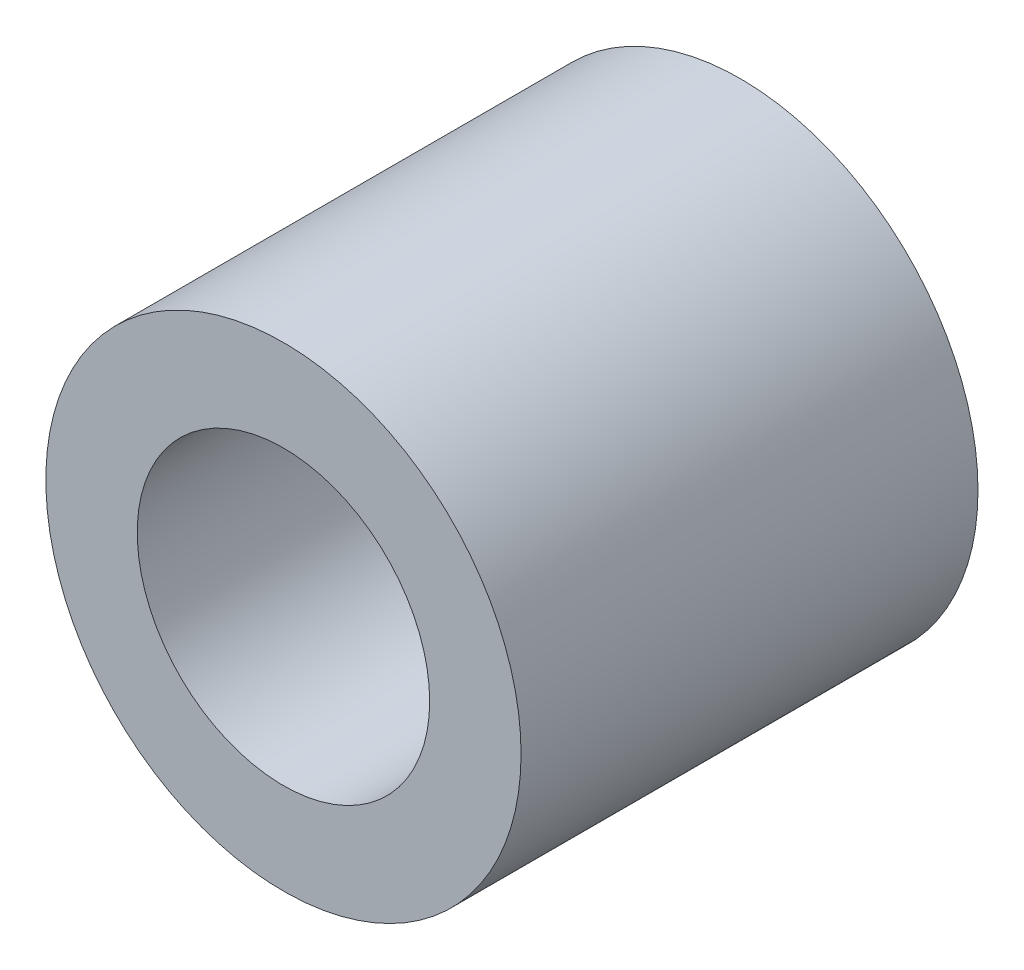
ISO-10303-21;
HEADER;
FILE_DESCRIPTION(('STEP AP214'),'2;1');
FILE_NAME('part.step','',(''),(''),'','','');
FILE_SCHEMA(('AUTOMOTIVE_DESIGN { 1 0 10303 214 1 1 1 1 }'));
ENDSEC;
DATA;
#1=APPLICATION_CONTEXT('core data for automotive mechanical design processes');
#2=APPLICATION_PROTOCOL_DEFINITION('international standard','automotive_design',2000,#1);
#3=PRODUCT_CONTEXT('',#1,'mechanical');
#4=PRODUCT('Part','Part','',(#3));
#5=PRODUCT_RELATED_PRODUCT_CATEGORY('part','',(#4));
#6=PRODUCT_DEFINITION_FORMATION('','',#4);
#7=PRODUCT_DEFINITION_CONTEXT('part definition',#1,'design');
#8=PRODUCT_DEFINITION('design','',#6,#7);
#9=PRODUCT_DEFINITION_SHAPE('','',#8);
#10=(LENGTH_UNIT() NAMED_UNIT(*) SI_UNIT(.MILLI.,.METRE.));
#11=(NAMED_UNIT(*) PLANE_ANGLE_UNIT() SI_UNIT($,.RADIAN.));
#12=(NAMED_UNIT(*) SI_UNIT($,.STERADIAN.) SOLID_ANGLE_UNIT());
#13=UNCERTAINTY_MEASURE_WITH_UNIT(LENGTH_MEASURE(1.E-05),#10,'distance_accuracy_value','');
#14=(GEOMETRIC_REPRESENTATION_CONTEXT(3) GLOBAL_UNCERTAINTY_ASSIGNED_CONTEXT((#13)) GLOBAL_UNIT_ASSIGNED_CONTEXT((#10,
#11,#12)) REPRESENTATION_CONTEXT('',''));
#15=CARTESIAN_POINT('',(0.,0.,0.));
#16=DIRECTION('',(0.,0.,1.));
#17=DIRECTION('',(1.,0.,0.));
#18=AXIS2_PLACEMENT_3D('',#15,#16,#17);
#19=CARTESIAN_POINT('',(1.45000000003573,330.999999999972,5.));
#20=DIRECTION('',(0.,0.,-1.));
#21=DIRECTION('',(-1.,0.,0.));
#22=AXIS2_PLACEMENT_3D('',#19,#20,#21);
#23=CYLINDRICAL_SURFACE('',#22,2.6);
#24=CARTESIAN_POINT('',(1.45000000003573,330.999999999972,5.));
#25=DIRECTION('',(0.,0.,1.));
#26=DIRECTION('',(1.,0.,0.));
#27=AXIS2_PLACEMENT_3D('',#24,#25,#26);
#28=CIRCLE('',#27,2.6);
#29=CARTESIAN_POINT('',(4.05000000003572,330.999999999972,5.));
#30=VERTEX_POINT('',#29);
#31=EDGE_CURVE('E10',#30,#30,#28,.T.);
#32=ORIENTED_EDGE('',*,*,#31,.F.);
#33=EDGE_LOOP('',(#32));
#34=FACE_BOUND('',#33,.T.);
#35=CARTESIAN_POINT('',(1.45000000003573,330.999999999972,0.));
#36=DIRECTION('',(0.,0.,1.));
#37=DIRECTION('',(1.,0.,0.));
#38=AXIS2_PLACEMENT_3D('',#35,#36,#37);
#39=CIRCLE('',#38,2.6);
#40=CARTESIAN_POINT('',(4.05000000003572,330.999999999972,0.));
#41=VERTEX_POINT('',#40);
#42=EDGE_CURVE('E33',#41,#41,#39,.T.);
#43=ORIENTED_EDGE('',*,*,#42,.T.);
#44=EDGE_LOOP('',(#43));
#45=FACE_BOUND('',#44,.T.);
#46=ADVANCED_FACE('F30',(#34,#45),#23,.T.);
#47=CARTESIAN_POINT('',(1.45000000003573,330.999999999972,5.));
#48=DIRECTION('',(0.,0.,1.));
#49=DIRECTION('',(1.,0.,0.));
#50=AXIS2_PLACEMENT_3D('',#47,#48,#49);
#51=PLANE('',#50);
#52=CARTESIAN_POINT('',(1.45000000003573,330.999999999972,5.));
#53=DIRECTION('',(0.,0.,1.));
#54=DIRECTION('',(1.,0.,0.));
#55=AXIS2_PLACEMENT_3D('',#52,#53,#54);
#56=CIRCLE('',#55,1.6);
#57=CARTESIAN_POINT('',(3.05000000003573,330.999999999972,5.));
#58=VERTEX_POINT('',#57);
#59=EDGE_CURVE('E44',#58,#58,#56,.T.);
#60=ORIENTED_EDGE('',*,*,#59,.F.);
#61=EDGE_LOOP('',(#60));
#62=FACE_BOUND('',#61,.T.);
#63=ORIENTED_EDGE('',*,*,#31,.T.);
#64=EDGE_LOOP('',(#63));
#65=FACE_BOUND('',#64,.T.);
#66=ADVANCED_FACE('F51',(#62,#65),#51,.T.);
#67=CARTESIAN_POINT('',(1.45000000003573,330.999999999972,0.));
#68=DIRECTION('',(0.,0.,1.));
#69=DIRECTION('',(1.,0.,0.));
#70=AXIS2_PLACEMENT_3D('',#67,#68,#69);
#71=PLANE('',#70);
#72=CARTESIAN_POINT('',(1.45000000003573,330.999999999972,0.));
#73=DIRECTION('',(0.,0.,1.));
#74=DIRECTION('',(1.,0.,0.));
#75=AXIS2_PLACEMENT_3D('',#72,#73,#74);
#76=CIRCLE('',#75,1.6);
#77=CARTESIAN_POINT('',(3.05000000003572,330.999999999972,0.));
#78=VERTEX_POINT('',#77);
#79=EDGE_CURVE('E40',#78,#78,#76,.T.);
#80=ORIENTED_EDGE('',*,*,#79,.T.);
#81=EDGE_LOOP('',(#80));
#82=FACE_BOUND('',#81,.T.);
#83=ORIENTED_EDGE('',*,*,#42,.F.);
#84=EDGE_LOOP('',(#83));
#85=FACE_BOUND('',#84,.T.);
#86=ADVANCED_FACE('F53',(#82,#85),#71,.F.);
#87=CARTESIAN_POINT('',(1.45000000003573,330.999999999972,5.));
#88=DIRECTION('',(0.,0.,1.));
#89=DIRECTION('',(1.,0.,0.));
#90=AXIS2_PLACEMENT_3D('',#87,#88,#89);
#91=CYLINDRICAL_SURFACE('',#90,1.6);
#92=ORIENTED_EDGE('',*,*,#59,.T.);
#93=EDGE_LOOP('',(#92));
#94=FACE_BOUND('',#93,.T.);
#95=ORIENTED_EDGE('',*,*,#79,.F.);
#96=EDGE_LOOP('',(#95));
#97=FACE_BOUND('',#96,.T.);
#98=ADVANCED_FACE('F48',(#94,#97),#91,.F.);
#99=CLOSED_SHELL('',(#46,#66,#86,#98));
#100=MANIFOLD_SOLID_BREP('B2',#99);
#101=ADVANCED_BREP_SHAPE_REPRESENTATION('',(#18,#100),#14);
#102=SHAPE_DEFINITION_REPRESENTATION(#9,#101);
ENDSEC;
END-ISO-10303-21;
